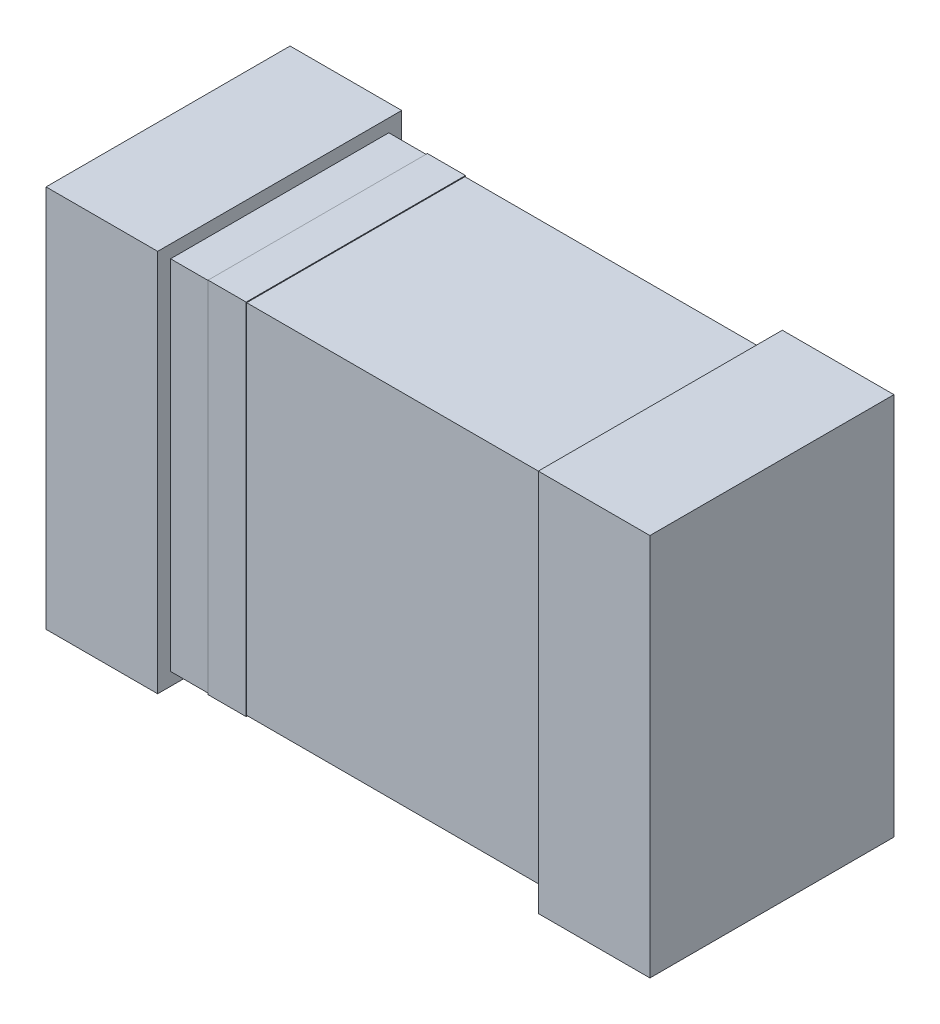
ISO-10303-21;
HEADER;
FILE_DESCRIPTION(('STEP AP214'),'2;1');
FILE_NAME('part.step','',(''),(''),'','','');
FILE_SCHEMA(('AUTOMOTIVE_DESIGN { 1 0 10303 214 1 1 1 1 }'));
ENDSEC;
DATA;
#1=APPLICATION_CONTEXT('core data for automotive mechanical design processes');
#2=APPLICATION_PROTOCOL_DEFINITION('international standard','automotive_design',2000,#1);
#3=PRODUCT_CONTEXT('',#1,'mechanical');
#4=PRODUCT('Part','Part','',(#3));
#5=PRODUCT_RELATED_PRODUCT_CATEGORY('part','',(#4));
#6=PRODUCT_DEFINITION_FORMATION('','',#4);
#7=PRODUCT_DEFINITION_CONTEXT('part definition',#1,'design');
#8=PRODUCT_DEFINITION('design','',#6,#7);
#9=PRODUCT_DEFINITION_SHAPE('','',#8);
#10=(LENGTH_UNIT() NAMED_UNIT(*) SI_UNIT(.MILLI.,.METRE.));
#11=(NAMED_UNIT(*) PLANE_ANGLE_UNIT() SI_UNIT($,.RADIAN.));
#12=(NAMED_UNIT(*) SI_UNIT($,.STERADIAN.) SOLID_ANGLE_UNIT());
#13=UNCERTAINTY_MEASURE_WITH_UNIT(LENGTH_MEASURE(1.E-05),#10,'distance_accuracy_value','');
#14=(GEOMETRIC_REPRESENTATION_CONTEXT(3) GLOBAL_UNCERTAINTY_ASSIGNED_CONTEXT((#13)) GLOBAL_UNIT_ASSIGNED_CONTEXT((#10,
#11,#12)) REPRESENTATION_CONTEXT('',''));
#15=CARTESIAN_POINT('',(0.,0.,0.));
#16=DIRECTION('',(0.,0.,1.));
#17=DIRECTION('',(1.,0.,0.));
#18=AXIS2_PLACEMENT_3D('',#15,#16,#17);
#19=CARTESIAN_POINT('',(0.624,-0.5859,0.0423));
#20=CARTESIAN_POINT('',(-0.624,-0.5859,0.0423));
#21=CARTESIAN_POINT('',(0.624,-0.5859,0.7578));
#22=CARTESIAN_POINT('',(-0.624,-0.5859,0.7578));
#23=B_SPLINE_SURFACE_WITH_KNOTS('',1,1,((#19,#20),(#21,#22)),.UNSPECIFIED.,.F.,.F.,.F.,(2,2),(2,
2),(0.,0.795),(-2.08,0.),.UNSPECIFIED.);
#24=DIRECTION('',(-1.,0.,0.));
#25=VECTOR('',#24,1.);
#26=CARTESIAN_POINT('',(0.624,-0.5859,0.0423));
#27=LINE('',#26,#25);
#28=CARTESIAN_POINT('',(0.624,-0.5859,0.0423));
#29=VERTEX_POINT('',#28);
#30=CARTESIAN_POINT('',(-0.624,-0.5859,0.0423));
#31=VERTEX_POINT('',#30);
#32=EDGE_CURVE('P0_E11',#29,#31,#27,.T.);
#33=DIRECTION('',(0.,0.,-1.));
#34=VECTOR('',#33,1.);
#35=CARTESIAN_POINT('',(0.624,-0.5859,0.7578));
#36=LINE('',#35,#34);
#37=CARTESIAN_POINT('',(0.624,-0.5859,0.7578));
#38=VERTEX_POINT('',#37);
#39=EDGE_CURVE('P0_E27',#38,#29,#36,.T.);
#40=DIRECTION('',(1.,0.,0.));
#41=VECTOR('',#40,1.);
#42=CARTESIAN_POINT('',(-0.624,-0.5859,0.7578));
#43=LINE('',#42,#41);
#44=CARTESIAN_POINT('',(-0.624,-0.5859,0.7578));
#45=VERTEX_POINT('',#44);
#46=EDGE_CURVE('P0_E98',#45,#38,#43,.T.);
#47=DIRECTION('',(0.,0.,1.));
#48=VECTOR('',#47,1.);
#49=CARTESIAN_POINT('',(-0.624,-0.5859,0.0423));
#50=LINE('',#49,#48);
#51=EDGE_CURVE('P0_E93',#31,#45,#50,.T.);
#52=ORIENTED_EDGE('',*,*,#32,.F.);
#53=ORIENTED_EDGE('',*,*,#39,.F.);
#54=ORIENTED_EDGE('',*,*,#46,.F.);
#55=ORIENTED_EDGE('',*,*,#51,.F.);
#56=EDGE_LOOP('',(#52,#53,#54,#55));
#57=FACE_BOUND('',#56,.T.);
#58=ADVANCED_FACE('P0_F17',(#57),#23,.T.);
#59=CARTESIAN_POINT('',(-0.624,-0.5859,0.0423));
#60=CARTESIAN_POINT('',(-0.624,0.5859,0.0423));
#61=CARTESIAN_POINT('',(-0.624,-0.5859,0.7578));
#62=CARTESIAN_POINT('',(-0.624,0.5859,0.7578));
#63=B_SPLINE_SURFACE_WITH_KNOTS('',1,1,((#59,#60),(#61,#62)),.UNSPECIFIED.,.F.,.F.,.F.,(2,2),(2,
2),(0.,0.795),(-1.302,0.),.UNSPECIFIED.);
#64=DIRECTION('',(0.,1.,0.));
#65=VECTOR('',#64,1.);
#66=CARTESIAN_POINT('',(-0.624,-0.5859,0.0423));
#67=LINE('',#66,#65);
#68=CARTESIAN_POINT('',(-0.624,0.5859,0.0423));
#69=VERTEX_POINT('',#68);
#70=EDGE_CURVE('P0_E75',#31,#69,#67,.T.);
#71=DIRECTION('',(0.,-1.,0.));
#72=VECTOR('',#71,1.);
#73=CARTESIAN_POINT('',(-0.624,0.5859,0.7578));
#74=LINE('',#73,#72);
#75=CARTESIAN_POINT('',(-0.624,0.5859,0.7578));
#76=VERTEX_POINT('',#75);
#77=EDGE_CURVE('P0_E78',#76,#45,#74,.T.);
#78=DIRECTION('',(0.,0.,-1.));
#79=VECTOR('',#78,1.);
#80=CARTESIAN_POINT('',(-0.624,0.5859,0.7578));
#81=LINE('',#80,#79);
#82=EDGE_CURVE('P0_E76',#76,#69,#81,.T.);
#83=ORIENTED_EDGE('',*,*,#70,.F.);
#84=ORIENTED_EDGE('',*,*,#51,.T.);
#85=ORIENTED_EDGE('',*,*,#77,.F.);
#86=ORIENTED_EDGE('',*,*,#82,.T.);
#87=EDGE_LOOP('',(#83,#84,#85,#86));
#88=FACE_BOUND('',#87,.T.);
#89=ADVANCED_FACE('P0_F110',(#88),#63,.T.);
#90=CARTESIAN_POINT('',(-0.624,0.5859,0.0423));
#91=CARTESIAN_POINT('',(0.624,0.5859,0.0423));
#92=CARTESIAN_POINT('',(-0.624,0.5859,0.7578));
#93=CARTESIAN_POINT('',(0.624,0.5859,0.7578));
#94=B_SPLINE_SURFACE_WITH_KNOTS('',1,1,((#90,#91),(#92,#93)),.UNSPECIFIED.,.F.,.F.,.F.,(2,2),(2,
2),(0.,0.795),(-2.08,0.),.UNSPECIFIED.);
#95=DIRECTION('',(1.,0.,0.));
#96=VECTOR('',#95,1.);
#97=CARTESIAN_POINT('',(-0.624,0.5859,0.0423));
#98=LINE('',#97,#96);
#99=CARTESIAN_POINT('',(0.624,0.5859,0.0423));
#100=VERTEX_POINT('',#99);
#101=EDGE_CURVE('P0_E61',#69,#100,#98,.T.);
#102=DIRECTION('',(-1.,0.,0.));
#103=VECTOR('',#102,1.);
#104=CARTESIAN_POINT('',(0.624,0.5859,0.7578));
#105=LINE('',#104,#103);
#106=CARTESIAN_POINT('',(0.624,0.5859,0.7578));
#107=VERTEX_POINT('',#106);
#108=EDGE_CURVE('P0_E64',#107,#76,#105,.T.);
#109=DIRECTION('',(0.,0.,-1.));
#110=VECTOR('',#109,1.);
#111=CARTESIAN_POINT('',(0.624,0.5859,0.7578));
#112=LINE('',#111,#110);
#113=EDGE_CURVE('P0_E56',#107,#100,#112,.T.);
#114=ORIENTED_EDGE('',*,*,#101,.F.);
#115=ORIENTED_EDGE('',*,*,#82,.F.);
#116=ORIENTED_EDGE('',*,*,#108,.F.);
#117=ORIENTED_EDGE('',*,*,#113,.T.);
#118=EDGE_LOOP('',(#114,#115,#116,#117));
#119=FACE_BOUND('',#118,.T.);
#120=ADVANCED_FACE('P0_F58',(#119),#94,.T.);
#121=CARTESIAN_POINT('',(0.624,0.5859,0.0423));
#122=CARTESIAN_POINT('',(0.624,-0.5859,0.0423));
#123=CARTESIAN_POINT('',(0.624,0.5859,0.7578));
#124=CARTESIAN_POINT('',(0.624,-0.5859,0.7578));
#125=B_SPLINE_SURFACE_WITH_KNOTS('',1,1,((#121,#122),(#123,#124)),.UNSPECIFIED.,.F.,.F.,.F.,(2,
2),(2,2),(0.,0.795),(-1.302,0.),.UNSPECIFIED.);
#126=DIRECTION('',(0.,-1.,0.));
#127=VECTOR('',#126,1.);
#128=CARTESIAN_POINT('',(0.624,0.5859,0.0423));
#129=LINE('',#128,#127);
#130=EDGE_CURVE('P0_E67',#100,#29,#129,.T.);
#131=DIRECTION('',(0.,1.,0.));
#132=VECTOR('',#131,1.);
#133=CARTESIAN_POINT('',(0.624,-0.5859,0.7578));
#134=LINE('',#133,#132);
#135=EDGE_CURVE('P0_E71',#38,#107,#134,.T.);
#136=ORIENTED_EDGE('',*,*,#130,.F.);
#137=ORIENTED_EDGE('',*,*,#113,.F.);
#138=ORIENTED_EDGE('',*,*,#135,.F.);
#139=ORIENTED_EDGE('',*,*,#39,.T.);
#140=EDGE_LOOP('',(#136,#137,#138,#139));
#141=FACE_BOUND('',#140,.T.);
#142=ADVANCED_FACE('P0_F69',(#141),#125,.T.);
#143=CARTESIAN_POINT('',(0.624,-0.5859,0.7578));
#144=CARTESIAN_POINT('',(-0.624,-0.5859,0.7578));
#145=CARTESIAN_POINT('',(0.624,0.5859,0.7578));
#146=CARTESIAN_POINT('',(-0.624,0.5859,0.7578));
#147=B_SPLINE_SURFACE_WITH_KNOTS('',1,1,((#143,#144),(#145,#146)),.UNSPECIFIED.,.F.,.F.,.F.,(2,
2),(2,2),(0.,1.302),(-2.08,0.),.UNSPECIFIED.);
#148=ORIENTED_EDGE('',*,*,#46,.T.);
#149=ORIENTED_EDGE('',*,*,#135,.T.);
#150=ORIENTED_EDGE('',*,*,#108,.T.);
#151=ORIENTED_EDGE('',*,*,#77,.T.);
#152=EDGE_LOOP('',(#148,#149,#150,#151));
#153=FACE_BOUND('',#152,.T.);
#154=ADVANCED_FACE('P0_F108',(#153),#147,.T.);
#155=CARTESIAN_POINT('',(-0.624,-0.5859,0.0423));
#156=CARTESIAN_POINT('',(0.624,-0.5859,0.0423));
#157=CARTESIAN_POINT('',(-0.624,0.5859,0.0423));
#158=CARTESIAN_POINT('',(0.624,0.5859,0.0423));
#159=B_SPLINE_SURFACE_WITH_KNOTS('',1,1,((#155,#156),(#157,#158)),.UNSPECIFIED.,.F.,.F.,.F.,(2,
2),(2,2),(-1.302,0.),(0.,2.08),.UNSPECIFIED.);
#160=ORIENTED_EDGE('',*,*,#101,.T.);
#161=ORIENTED_EDGE('',*,*,#130,.T.);
#162=ORIENTED_EDGE('',*,*,#32,.T.);
#163=ORIENTED_EDGE('',*,*,#70,.T.);
#164=EDGE_LOOP('',(#160,#161,#162,#163));
#165=FACE_BOUND('',#164,.T.);
#166=ADVANCED_FACE('P0_F73',(#165),#159,.T.);
#167=CLOSED_SHELL('',(#58,#89,#120,#142,#154,#166));
#168=MANIFOLD_SOLID_BREP('P0_B1',#167);
#169=CARTESIAN_POINT('',(0.99,-0.6282,0.));
#170=CARTESIAN_POINT('',(0.624,-0.6282,0.));
#171=CARTESIAN_POINT('',(0.99,-0.6282,0.8001));
#172=CARTESIAN_POINT('',(0.624,-0.6282,0.8001));
#173=B_SPLINE_SURFACE_WITH_KNOTS('',1,1,((#169,#170),(#171,#172)),.UNSPECIFIED.,.F.,.F.,.F.,(2,
2),(2,2),(0.,0.889),(-0.61,0.),.UNSPECIFIED.);
#174=DIRECTION('',(-1.,0.,0.));
#175=VECTOR('',#174,1.);
#176=CARTESIAN_POINT('',(0.99,-0.6282,0.));
#177=LINE('',#176,#175);
#178=CARTESIAN_POINT('',(0.99,-0.6282,0.));
#179=VERTEX_POINT('',#178);
#180=CARTESIAN_POINT('',(0.624,-0.6282,0.));
#181=VERTEX_POINT('',#180);
#182=EDGE_CURVE('P1_E11',#179,#181,#177,.T.);
#183=DIRECTION('',(0.,0.,-1.));
#184=VECTOR('',#183,1.);
#185=CARTESIAN_POINT('',(0.99,-0.6282,0.8001));
#186=LINE('',#185,#184);
#187=CARTESIAN_POINT('',(0.99,-0.6282,0.8001));
#188=VERTEX_POINT('',#187);
#189=EDGE_CURVE('P1_E27',#188,#179,#186,.T.);
#190=DIRECTION('',(1.,0.,0.));
#191=VECTOR('',#190,1.);
#192=CARTESIAN_POINT('',(0.624,-0.6282,0.8001));
#193=LINE('',#192,#191);
#194=CARTESIAN_POINT('',(0.624,-0.6282,0.8001));
#195=VERTEX_POINT('',#194);
#196=EDGE_CURVE('P1_E98',#195,#188,#193,.T.);
#197=DIRECTION('',(0.,0.,1.));
#198=VECTOR('',#197,1.);
#199=CARTESIAN_POINT('',(0.624,-0.6282,0.));
#200=LINE('',#199,#198);
#201=EDGE_CURVE('P1_E93',#181,#195,#200,.T.);
#202=ORIENTED_EDGE('',*,*,#182,.F.);
#203=ORIENTED_EDGE('',*,*,#189,.F.);
#204=ORIENTED_EDGE('',*,*,#196,.F.);
#205=ORIENTED_EDGE('',*,*,#201,.F.);
#206=EDGE_LOOP('',(#202,#203,#204,#205));
#207=FACE_BOUND('',#206,.T.);
#208=ADVANCED_FACE('P1_F17',(#207),#173,.T.);
#209=CARTESIAN_POINT('',(0.624,-0.6282,0.));
#210=CARTESIAN_POINT('',(0.624,0.6282,0.));
#211=CARTESIAN_POINT('',(0.624,-0.6282,0.8001));
#212=CARTESIAN_POINT('',(0.624,0.6282,0.8001));
#213=B_SPLINE_SURFACE_WITH_KNOTS('',1,1,((#209,#210),(#211,#212)),.UNSPECIFIED.,.F.,.F.,.F.,(2,
2),(2,2),(0.,0.889),(-1.396,0.),.UNSPECIFIED.);
#214=DIRECTION('',(0.,1.,0.));
#215=VECTOR('',#214,1.);
#216=CARTESIAN_POINT('',(0.624,-0.6282,0.));
#217=LINE('',#216,#215);
#218=CARTESIAN_POINT('',(0.624,0.6282,0.));
#219=VERTEX_POINT('',#218);
#220=EDGE_CURVE('P1_E75',#181,#219,#217,.T.);
#221=DIRECTION('',(0.,-1.,0.));
#222=VECTOR('',#221,1.);
#223=CARTESIAN_POINT('',(0.624,0.6282,0.8001));
#224=LINE('',#223,#222);
#225=CARTESIAN_POINT('',(0.624,0.6282,0.8001));
#226=VERTEX_POINT('',#225);
#227=EDGE_CURVE('P1_E78',#226,#195,#224,.T.);
#228=DIRECTION('',(0.,0.,-1.));
#229=VECTOR('',#228,1.);
#230=CARTESIAN_POINT('',(0.624,0.6282,0.8001));
#231=LINE('',#230,#229);
#232=EDGE_CURVE('P1_E76',#226,#219,#231,.T.);
#233=ORIENTED_EDGE('',*,*,#220,.F.);
#234=ORIENTED_EDGE('',*,*,#201,.T.);
#235=ORIENTED_EDGE('',*,*,#227,.F.);
#236=ORIENTED_EDGE('',*,*,#232,.T.);
#237=EDGE_LOOP('',(#233,#234,#235,#236));
#238=FACE_BOUND('',#237,.T.);
#239=ADVANCED_FACE('P1_F110',(#238),#213,.T.);
#240=CARTESIAN_POINT('',(0.624,0.6282,0.));
#241=CARTESIAN_POINT('',(0.99,0.6282,0.));
#242=CARTESIAN_POINT('',(0.624,0.6282,0.8001));
#243=CARTESIAN_POINT('',(0.99,0.6282,0.8001));
#244=B_SPLINE_SURFACE_WITH_KNOTS('',1,1,((#240,#241),(#242,#243)),.UNSPECIFIED.,.F.,.F.,.F.,(2,
2),(2,2),(0.,0.889),(-0.61,0.),.UNSPECIFIED.);
#245=DIRECTION('',(1.,0.,0.));
#246=VECTOR('',#245,1.);
#247=CARTESIAN_POINT('',(0.624,0.6282,0.));
#248=LINE('',#247,#246);
#249=CARTESIAN_POINT('',(0.99,0.6282,0.));
#250=VERTEX_POINT('',#249);
#251=EDGE_CURVE('P1_E61',#219,#250,#248,.T.);
#252=DIRECTION('',(-1.,0.,0.));
#253=VECTOR('',#252,1.);
#254=CARTESIAN_POINT('',(0.99,0.6282,0.8001));
#255=LINE('',#254,#253);
#256=CARTESIAN_POINT('',(0.99,0.6282,0.8001));
#257=VERTEX_POINT('',#256);
#258=EDGE_CURVE('P1_E64',#257,#226,#255,.T.);
#259=DIRECTION('',(0.,0.,-1.));
#260=VECTOR('',#259,1.);
#261=CARTESIAN_POINT('',(0.99,0.6282,0.8001));
#262=LINE('',#261,#260);
#263=EDGE_CURVE('P1_E56',#257,#250,#262,.T.);
#264=ORIENTED_EDGE('',*,*,#251,.F.);
#265=ORIENTED_EDGE('',*,*,#232,.F.);
#266=ORIENTED_EDGE('',*,*,#258,.F.);
#267=ORIENTED_EDGE('',*,*,#263,.T.);
#268=EDGE_LOOP('',(#264,#265,#266,#267));
#269=FACE_BOUND('',#268,.T.);
#270=ADVANCED_FACE('P1_F58',(#269),#244,.T.);
#271=CARTESIAN_POINT('',(0.99,0.6282,0.));
#272=CARTESIAN_POINT('',(0.99,-0.6282,0.));
#273=CARTESIAN_POINT('',(0.99,0.6282,0.8001));
#274=CARTESIAN_POINT('',(0.99,-0.6282,0.8001));
#275=B_SPLINE_SURFACE_WITH_KNOTS('',1,1,((#271,#272),(#273,#274)),.UNSPECIFIED.,.F.,.F.,.F.,(2,
2),(2,2),(0.,0.889),(-1.396,0.),.UNSPECIFIED.);
#276=DIRECTION('',(0.,-1.,0.));
#277=VECTOR('',#276,1.);
#278=CARTESIAN_POINT('',(0.99,0.6282,0.));
#279=LINE('',#278,#277);
#280=EDGE_CURVE('P1_E67',#250,#179,#279,.T.);
#281=DIRECTION('',(0.,1.,0.));
#282=VECTOR('',#281,1.);
#283=CARTESIAN_POINT('',(0.99,-0.6282,0.8001));
#284=LINE('',#283,#282);
#285=EDGE_CURVE('P1_E71',#188,#257,#284,.T.);
#286=ORIENTED_EDGE('',*,*,#280,.F.);
#287=ORIENTED_EDGE('',*,*,#263,.F.);
#288=ORIENTED_EDGE('',*,*,#285,.F.);
#289=ORIENTED_EDGE('',*,*,#189,.T.);
#290=EDGE_LOOP('',(#286,#287,#288,#289));
#291=FACE_BOUND('',#290,.T.);
#292=ADVANCED_FACE('P1_F69',(#291),#275,.T.);
#293=CARTESIAN_POINT('',(0.99,-0.6282,0.8001));
#294=CARTESIAN_POINT('',(0.624,-0.6282,0.8001));
#295=CARTESIAN_POINT('',(0.99,0.6282,0.8001));
#296=CARTESIAN_POINT('',(0.624,0.6282,0.8001));
#297=B_SPLINE_SURFACE_WITH_KNOTS('',1,1,((#293,#294),(#295,#296)),.UNSPECIFIED.,.F.,.F.,.F.,(2,
2),(2,2),(0.,1.396),(-0.61,0.),.UNSPECIFIED.);
#298=ORIENTED_EDGE('',*,*,#196,.T.);
#299=ORIENTED_EDGE('',*,*,#285,.T.);
#300=ORIENTED_EDGE('',*,*,#258,.T.);
#301=ORIENTED_EDGE('',*,*,#227,.T.);
#302=EDGE_LOOP('',(#298,#299,#300,#301));
#303=FACE_BOUND('',#302,.T.);
#304=ADVANCED_FACE('P1_F108',(#303),#297,.T.);
#305=CARTESIAN_POINT('',(0.624,-0.6282,0.));
#306=CARTESIAN_POINT('',(0.99,-0.6282,0.));
#307=CARTESIAN_POINT('',(0.624,0.6282,0.));
#308=CARTESIAN_POINT('',(0.99,0.6282,0.));
#309=B_SPLINE_SURFACE_WITH_KNOTS('',1,1,((#305,#306),(#307,#308)),.UNSPECIFIED.,.F.,.F.,.F.,(2,
2),(2,2),(-1.396,0.),(0.,0.61),.UNSPECIFIED.);
#310=ORIENTED_EDGE('',*,*,#251,.T.);
#311=ORIENTED_EDGE('',*,*,#280,.T.);
#312=ORIENTED_EDGE('',*,*,#182,.T.);
#313=ORIENTED_EDGE('',*,*,#220,.T.);
#314=EDGE_LOOP('',(#310,#311,#312,#313));
#315=FACE_BOUND('',#314,.T.);
#316=ADVANCED_FACE('P1_F73',(#315),#309,.T.);
#317=CLOSED_SHELL('',(#208,#239,#270,#292,#304,#316));
#318=MANIFOLD_SOLID_BREP('P1_B1',#317);
#319=CARTESIAN_POINT('',(-0.624,-0.6282,0.));
#320=CARTESIAN_POINT('',(-0.99,-0.6282,0.));
#321=CARTESIAN_POINT('',(-0.624,-0.6282,0.8001));
#322=CARTESIAN_POINT('',(-0.99,-0.6282,0.8001));
#323=B_SPLINE_SURFACE_WITH_KNOTS('',1,1,((#319,#320),(#321,#322)),.UNSPECIFIED.,.F.,.F.,.F.,(2,
2),(2,2),(0.,0.889),(-0.61,0.),.UNSPECIFIED.);
#324=DIRECTION('',(-1.,0.,0.));
#325=VECTOR('',#324,1.);
#326=CARTESIAN_POINT('',(-0.624,-0.6282,0.));
#327=LINE('',#326,#325);
#328=CARTESIAN_POINT('',(-0.624,-0.6282,0.));
#329=VERTEX_POINT('',#328);
#330=CARTESIAN_POINT('',(-0.99,-0.6282,0.));
#331=VERTEX_POINT('',#330);
#332=EDGE_CURVE('P2_E11',#329,#331,#327,.T.);
#333=DIRECTION('',(0.,0.,-1.));
#334=VECTOR('',#333,1.);
#335=CARTESIAN_POINT('',(-0.624,-0.6282,0.8001));
#336=LINE('',#335,#334);
#337=CARTESIAN_POINT('',(-0.624,-0.6282,0.8001));
#338=VERTEX_POINT('',#337);
#339=EDGE_CURVE('P2_E27',#338,#329,#336,.T.);
#340=DIRECTION('',(1.,0.,0.));
#341=VECTOR('',#340,1.);
#342=CARTESIAN_POINT('',(-0.99,-0.6282,0.8001));
#343=LINE('',#342,#341);
#344=CARTESIAN_POINT('',(-0.99,-0.6282,0.8001));
#345=VERTEX_POINT('',#344);
#346=EDGE_CURVE('P2_E98',#345,#338,#343,.T.);
#347=DIRECTION('',(0.,0.,1.));
#348=VECTOR('',#347,1.);
#349=CARTESIAN_POINT('',(-0.99,-0.6282,0.));
#350=LINE('',#349,#348);
#351=EDGE_CURVE('P2_E93',#331,#345,#350,.T.);
#352=ORIENTED_EDGE('',*,*,#332,.F.);
#353=ORIENTED_EDGE('',*,*,#339,.F.);
#354=ORIENTED_EDGE('',*,*,#346,.F.);
#355=ORIENTED_EDGE('',*,*,#351,.F.);
#356=EDGE_LOOP('',(#352,#353,#354,#355));
#357=FACE_BOUND('',#356,.T.);
#358=ADVANCED_FACE('P2_F17',(#357),#323,.T.);
#359=CARTESIAN_POINT('',(-0.99,-0.6282,0.));
#360=CARTESIAN_POINT('',(-0.99,0.6282,0.));
#361=CARTESIAN_POINT('',(-0.99,-0.6282,0.8001));
#362=CARTESIAN_POINT('',(-0.99,0.6282,0.8001));
#363=B_SPLINE_SURFACE_WITH_KNOTS('',1,1,((#359,#360),(#361,#362)),.UNSPECIFIED.,.F.,.F.,.F.,(2,
2),(2,2),(0.,0.889),(-1.396,0.),.UNSPECIFIED.);
#364=DIRECTION('',(0.,1.,0.));
#365=VECTOR('',#364,1.);
#366=CARTESIAN_POINT('',(-0.99,-0.6282,0.));
#367=LINE('',#366,#365);
#368=CARTESIAN_POINT('',(-0.99,0.6282,0.));
#369=VERTEX_POINT('',#368);
#370=EDGE_CURVE('P2_E75',#331,#369,#367,.T.);
#371=DIRECTION('',(0.,-1.,0.));
#372=VECTOR('',#371,1.);
#373=CARTESIAN_POINT('',(-0.99,0.6282,0.8001));
#374=LINE('',#373,#372);
#375=CARTESIAN_POINT('',(-0.99,0.6282,0.8001));
#376=VERTEX_POINT('',#375);
#377=EDGE_CURVE('P2_E78',#376,#345,#374,.T.);
#378=DIRECTION('',(0.,0.,-1.));
#379=VECTOR('',#378,1.);
#380=CARTESIAN_POINT('',(-0.99,0.6282,0.8001));
#381=LINE('',#380,#379);
#382=EDGE_CURVE('P2_E76',#376,#369,#381,.T.);
#383=ORIENTED_EDGE('',*,*,#370,.F.);
#384=ORIENTED_EDGE('',*,*,#351,.T.);
#385=ORIENTED_EDGE('',*,*,#377,.F.);
#386=ORIENTED_EDGE('',*,*,#382,.T.);
#387=EDGE_LOOP('',(#383,#384,#385,#386));
#388=FACE_BOUND('',#387,.T.);
#389=ADVANCED_FACE('P2_F110',(#388),#363,.T.);
#390=CARTESIAN_POINT('',(-0.99,0.6282,0.));
#391=CARTESIAN_POINT('',(-0.624,0.6282,0.));
#392=CARTESIAN_POINT('',(-0.99,0.6282,0.8001));
#393=CARTESIAN_POINT('',(-0.624,0.6282,0.8001));
#394=B_SPLINE_SURFACE_WITH_KNOTS('',1,1,((#390,#391),(#392,#393)),.UNSPECIFIED.,.F.,.F.,.F.,(2,
2),(2,2),(0.,0.889),(-0.61,0.),.UNSPECIFIED.);
#395=DIRECTION('',(1.,0.,0.));
#396=VECTOR('',#395,1.);
#397=CARTESIAN_POINT('',(-0.99,0.6282,0.));
#398=LINE('',#397,#396);
#399=CARTESIAN_POINT('',(-0.624,0.6282,0.));
#400=VERTEX_POINT('',#399);
#401=EDGE_CURVE('P2_E61',#369,#400,#398,.T.);
#402=DIRECTION('',(-1.,0.,0.));
#403=VECTOR('',#402,1.);
#404=CARTESIAN_POINT('',(-0.624,0.6282,0.8001));
#405=LINE('',#404,#403);
#406=CARTESIAN_POINT('',(-0.624,0.6282,0.8001));
#407=VERTEX_POINT('',#406);
#408=EDGE_CURVE('P2_E64',#407,#376,#405,.T.);
#409=DIRECTION('',(0.,0.,-1.));
#410=VECTOR('',#409,1.);
#411=CARTESIAN_POINT('',(-0.624,0.6282,0.8001));
#412=LINE('',#411,#410);
#413=EDGE_CURVE('P2_E56',#407,#400,#412,.T.);
#414=ORIENTED_EDGE('',*,*,#401,.F.);
#415=ORIENTED_EDGE('',*,*,#382,.F.);
#416=ORIENTED_EDGE('',*,*,#408,.F.);
#417=ORIENTED_EDGE('',*,*,#413,.T.);
#418=EDGE_LOOP('',(#414,#415,#416,#417));
#419=FACE_BOUND('',#418,.T.);
#420=ADVANCED_FACE('P2_F58',(#419),#394,.T.);
#421=CARTESIAN_POINT('',(-0.624,0.6282,0.));
#422=CARTESIAN_POINT('',(-0.624,-0.6282,0.));
#423=CARTESIAN_POINT('',(-0.624,0.6282,0.8001));
#424=CARTESIAN_POINT('',(-0.624,-0.6282,0.8001));
#425=B_SPLINE_SURFACE_WITH_KNOTS('',1,1,((#421,#422),(#423,#424)),.UNSPECIFIED.,.F.,.F.,.F.,(2,
2),(2,2),(0.,0.889),(-1.396,0.),.UNSPECIFIED.);
#426=DIRECTION('',(0.,-1.,0.));
#427=VECTOR('',#426,1.);
#428=CARTESIAN_POINT('',(-0.624,0.6282,0.));
#429=LINE('',#428,#427);
#430=EDGE_CURVE('P2_E67',#400,#329,#429,.T.);
#431=DIRECTION('',(0.,1.,0.));
#432=VECTOR('',#431,1.);
#433=CARTESIAN_POINT('',(-0.624,-0.6282,0.8001));
#434=LINE('',#433,#432);
#435=EDGE_CURVE('P2_E71',#338,#407,#434,.T.);
#436=ORIENTED_EDGE('',*,*,#430,.F.);
#437=ORIENTED_EDGE('',*,*,#413,.F.);
#438=ORIENTED_EDGE('',*,*,#435,.F.);
#439=ORIENTED_EDGE('',*,*,#339,.T.);
#440=EDGE_LOOP('',(#436,#437,#438,#439));
#441=FACE_BOUND('',#440,.T.);
#442=ADVANCED_FACE('P2_F69',(#441),#425,.T.);
#443=CARTESIAN_POINT('',(-0.624,-0.6282,0.8001));
#444=CARTESIAN_POINT('',(-0.99,-0.6282,0.8001));
#445=CARTESIAN_POINT('',(-0.624,0.6282,0.8001));
#446=CARTESIAN_POINT('',(-0.99,0.6282,0.8001));
#447=B_SPLINE_SURFACE_WITH_KNOTS('',1,1,((#443,#444),(#445,#446)),.UNSPECIFIED.,.F.,.F.,.F.,(2,
2),(2,2),(0.,1.396),(-0.61,0.),.UNSPECIFIED.);
#448=ORIENTED_EDGE('',*,*,#346,.T.);
#449=ORIENTED_EDGE('',*,*,#435,.T.);
#450=ORIENTED_EDGE('',*,*,#408,.T.);
#451=ORIENTED_EDGE('',*,*,#377,.T.);
#452=EDGE_LOOP('',(#448,#449,#450,#451));
#453=FACE_BOUND('',#452,.T.);
#454=ADVANCED_FACE('P2_F108',(#453),#447,.T.);
#455=CARTESIAN_POINT('',(-0.99,-0.6282,0.));
#456=CARTESIAN_POINT('',(-0.624,-0.6282,0.));
#457=CARTESIAN_POINT('',(-0.99,0.6282,0.));
#458=CARTESIAN_POINT('',(-0.624,0.6282,0.));
#459=B_SPLINE_SURFACE_WITH_KNOTS('',1,1,((#455,#456),(#457,#458)),.UNSPECIFIED.,.F.,.F.,.F.,(2,
2),(2,2),(-1.396,0.),(0.,0.61),.UNSPECIFIED.);
#460=ORIENTED_EDGE('',*,*,#401,.T.);
#461=ORIENTED_EDGE('',*,*,#430,.T.);
#462=ORIENTED_EDGE('',*,*,#332,.T.);
#463=ORIENTED_EDGE('',*,*,#370,.T.);
#464=EDGE_LOOP('',(#460,#461,#462,#463));
#465=FACE_BOUND('',#464,.T.);
#466=ADVANCED_FACE('P2_F73',(#465),#459,.T.);
#467=CLOSED_SHELL('',(#358,#389,#420,#442,#454,#466));
#468=MANIFOLD_SOLID_BREP('P2_B1',#467);
#469=CARTESIAN_POINT('',(-0.4992,-0.5886,0.0405));
#470=CARTESIAN_POINT('',(-0.3744,-0.5886,0.0405));
#471=CARTESIAN_POINT('',(-0.4992,0.5886,0.0405));
#472=CARTESIAN_POINT('',(-0.3744,0.5886,0.0405));
#473=B_SPLINE_SURFACE_WITH_KNOTS('',1,1,((#469,#470),(#471,#472)),.UNSPECIFIED.,.F.,.F.,.F.,(2,
2),(2,2),(0.,1.308),(0.,1.),.UNSPECIFIED.);
#474=DIRECTION('',(-1.,0.,0.));
#475=VECTOR('',#474,1.);
#476=CARTESIAN_POINT('',(-0.3744,0.5886,0.0405));
#477=LINE('',#476,#475);
#478=CARTESIAN_POINT('',(-0.3744,0.5886,0.0405));
#479=VERTEX_POINT('',#478);
#480=CARTESIAN_POINT('',(-0.4992,0.5886,0.0405));
#481=VERTEX_POINT('',#480);
#482=EDGE_CURVE('P3_E11',#479,#481,#477,.T.);
#483=DIRECTION('',(0.,1.,0.));
#484=VECTOR('',#483,1.);
#485=CARTESIAN_POINT('',(-0.3744,-0.5886,0.0405));
#486=LINE('',#485,#484);
#487=CARTESIAN_POINT('',(-0.3744,-0.5886,0.0405));
#488=VERTEX_POINT('',#487);
#489=EDGE_CURVE('P3_E27',#488,#479,#486,.T.);
#490=DIRECTION('',(1.,0.,0.));
#491=VECTOR('',#490,1.);
#492=CARTESIAN_POINT('',(-0.4992,-0.5886,0.0405));
#493=LINE('',#492,#491);
#494=CARTESIAN_POINT('',(-0.4992,-0.5886,0.0405));
#495=VERTEX_POINT('',#494);
#496=EDGE_CURVE('P3_E313',#495,#488,#493,.T.);
#497=DIRECTION('',(0.,-1.,0.));
#498=VECTOR('',#497,1.);
#499=CARTESIAN_POINT('',(-0.4992,0.5886,0.0405));
#500=LINE('',#499,#498);
#501=EDGE_CURVE('P3_E311',#481,#495,#500,.T.);
#502=ORIENTED_EDGE('',*,*,#482,.F.);
#503=ORIENTED_EDGE('',*,*,#489,.F.);
#504=ORIENTED_EDGE('',*,*,#496,.F.);
#505=ORIENTED_EDGE('',*,*,#501,.F.);
#506=EDGE_LOOP('',(#502,#503,#504,#505));
#507=FACE_BOUND('',#506,.T.);
#508=ADVANCED_FACE('P3_F17',(#507),#473,.T.);
#509=CARTESIAN_POINT('',(-0.4992,-0.5886,0.04005));
#510=CARTESIAN_POINT('',(-0.4992,0.5886,0.04005));
#511=CARTESIAN_POINT('',(-0.4992,-0.5886,0.7596));
#512=CARTESIAN_POINT('',(-0.4992,0.5886,0.7596));
#513=B_SPLINE_SURFACE_WITH_KNOTS('',1,1,((#509,#510),(#511,#512)),.UNSPECIFIED.,.F.,.F.,.F.,(2,
2),(2,2),(-0.0005,0.799),(-1.308,0.),.UNSPECIFIED.);
#514=CARTESIAN_POINT('',(-0.4992,-0.5859,0.0423));
#515=CARTESIAN_POINT('',(-0.4992,-0.585993735142403,0.0422062639200135));
#516=CARTESIAN_POINT('',(-0.4992,-0.58608749826612,0.0421125016768239));
#517=CARTESIAN_POINT('',(-0.4992,-0.586276781722621,0.0419267343713832));
#518=CARTESIAN_POINT('',(-0.4992,-0.58637230246205,0.0418347297260684));
#519=CARTESIAN_POINT('',(-0.4992,-0.586566907976538,0.0416541955323229));
#520=CARTESIAN_POINT('',(-0.4992,-0.586665997953318,0.0415656714844321));
#521=CARTESIAN_POINT('',(-0.4992,-0.586818381228817,0.0414370002784137));
#522=CARTESIAN_POINT('',(-0.4992,-0.586869883889863,0.0413947328058684));
#523=CARTESIAN_POINT('',(-0.4992,-0.586974427970702,0.0413117280653649));
#524=CARTESIAN_POINT('',(-0.4992,-0.587027474436501,0.04127099712993));
#525=CARTESIAN_POINT('',(-0.4992,-0.58713532359097,0.0411912825890379));
#526=CARTESIAN_POINT('',(-0.4992,-0.587190134383442,0.0411523099184189));
#527=CARTESIAN_POINT('',(-0.4992,-0.587301729089315,0.0410763260499531));
#528=CARTESIAN_POINT('',(-0.4992,-0.587358525043825,0.041039332489288));
#529=CARTESIAN_POINT('',(-0.4992,-0.587474305905673,0.0409675192010876));
#530=CARTESIAN_POINT('',(-0.4992,-0.587533307530253,0.0409327263625079));
#531=CARTESIAN_POINT('',(-0.4992,-0.587653714783258,0.0408655241180873));
#532=CARTESIAN_POINT('',(-0.4992,-0.587715142233673,0.0408331537315954));
#533=CARTESIAN_POINT('',(-0.4992,-0.587840615778612,0.0407710035166399));
#534=CARTESIAN_POINT('',(-0.4992,-0.587904688746364,0.0407412778607145));
#535=CARTESIAN_POINT('',(-0.4992,-0.588035667878086,0.0406846199121212));
#536=CARTESIAN_POINT('',(-0.4992,-0.588102605296496,0.0406577597912359));
#537=CARTESIAN_POINT('',(-0.4992,-0.588239529275563,0.0406070383472301));
#538=CARTESIAN_POINT('',(-0.4992,-0.588309550161255,0.0405832697234303));
#539=CARTESIAN_POINT('',(-0.4992,-0.588452855882658,0.0405389139686466));
#540=CARTESIAN_POINT('',(-0.4992,-0.58852617612056,0.0405184411037751));
#541=CARTESIAN_POINT('',(-0.4992,-0.5886,0.0405));
#542=B_SPLINE_CURVE_WITH_KNOTS('',3,(#514,#515,#516,#517,#518,#519,#520,#521,#522,#523,#524,
#525,#526,#527,#528,#529,#530,#531,#532,#533,#534,#535,#536,#537,#538,#539,#540,#541),
.UNSPECIFIED.,.F.,.F.,(4,2,2,2,2,2,2,2,2,2,2,2,2,4),(0.,0.000397749506539428,
0.000795592223787354,0.00119404027913931,0.00139389055657924,0.001594490258461,
0.001796201696195,0.00199948386034232,0.00220489946531643,0.00241311916605503,
0.00262492240881615,0.00284119457749307,0.00306292040021625,0.0032911739460783),.UNSPECIFIED.);
#543=CARTESIAN_POINT('',(-0.4992,-0.5859,0.0423));
#544=VERTEX_POINT('',#543);
#545=EDGE_CURVE('P3_E166',#544,#495,#542,.T.);
#546=DIRECTION('',(0.,-1.,0.));
#547=VECTOR('',#546,1.);
#548=CARTESIAN_POINT('',(-0.4992,0.5859,0.0423));
#549=LINE('',#548,#547);
#550=CARTESIAN_POINT('',(-0.4992,0.5859,0.0423));
#551=VERTEX_POINT('',#550);
#552=EDGE_CURVE('P3_E333',#551,#544,#549,.T.);
#553=DIRECTION('',(0.,0.,-1.));
#554=VECTOR('',#553,1.);
#555=CARTESIAN_POINT('',(-0.4992,0.5859,0.7578));
#556=LINE('',#555,#554);
#557=CARTESIAN_POINT('',(-0.4992,0.5859,0.7578));
#558=VERTEX_POINT('',#557);
#559=EDGE_CURVE('P3_E332',#558,#551,#556,.T.);
#560=CARTESIAN_POINT('',(-0.4992,0.5886,0.7596));
#561=CARTESIAN_POINT('',(-0.4992,0.588506264857597,0.759506263920014));
#562=CARTESIAN_POINT('',(-0.4992,0.58841250173388,0.759412501676824));
#563=CARTESIAN_POINT('',(-0.4992,0.588223218277379,0.759226734371383));
#564=CARTESIAN_POINT('',(-0.4992,0.588127697537949,0.759134729726069));
#565=CARTESIAN_POINT('',(-0.4992,0.587933092023462,0.758954195532323));
#566=CARTESIAN_POINT('',(-0.4992,0.587834002046682,0.758865671484432));
#567=CARTESIAN_POINT('',(-0.4992,0.587681618771183,0.758737000278414));
#568=CARTESIAN_POINT('',(-0.4992,0.587630116110136,0.758694732805868));
#569=CARTESIAN_POINT('',(-0.4992,0.587525572029298,0.758611728065365));
#570=CARTESIAN_POINT('',(-0.4992,0.587472525563499,0.75857099712993));
#571=CARTESIAN_POINT('',(-0.4992,0.58736467640903,0.758491282589038));
#572=CARTESIAN_POINT('',(-0.4992,0.587309865616558,0.758452309918419));
#573=CARTESIAN_POINT('',(-0.4992,0.587198270910685,0.758376326049953));
#574=CARTESIAN_POINT('',(-0.4992,0.587141474956175,0.758339332489288));
#575=CARTESIAN_POINT('',(-0.4992,0.587025694094327,0.758267519201087));
#576=CARTESIAN_POINT('',(-0.4992,0.586966692469747,0.758232726362508));
#577=CARTESIAN_POINT('',(-0.4992,0.586846285216742,0.758165524118087));
#578=CARTESIAN_POINT('',(-0.4992,0.586784857766327,0.758133153731595));
#579=CARTESIAN_POINT('',(-0.4992,0.586659384221388,0.75807100351664));
#580=CARTESIAN_POINT('',(-0.4992,0.586595311253636,0.758041277860715));
#581=CARTESIAN_POINT('',(-0.4992,0.586464332121913,0.757984619912121));
#582=CARTESIAN_POINT('',(-0.4992,0.586397394703504,0.757957759791236));
#583=CARTESIAN_POINT('',(-0.4992,0.586260470724436,0.75790703834723));
#584=CARTESIAN_POINT('',(-0.4992,0.586190449838745,0.75788326972343));
#585=CARTESIAN_POINT('',(-0.4992,0.586047144117341,0.757838913968646));
#586=CARTESIAN_POINT('',(-0.4992,0.58597382387944,0.757818441103775));
#587=CARTESIAN_POINT('',(-0.4992,0.5859,0.7578));
#588=B_SPLINE_CURVE_WITH_KNOTS('',3,(#560,#561,#562,#563,#564,#565,#566,#567,#568,#569,#570,
#571,#572,#573,#574,#575,#576,#577,#578,#579,#580,#581,#582,#583,#584,#585,#586,#587),
.UNSPECIFIED.,.F.,.F.,(4,2,2,2,2,2,2,2,2,2,2,2,2,4),(0.,0.000397749506539332,
0.000795592223787457,0.0011940402791393,0.00139389055657941,0.00159449025846113,
0.00179620169619526,0.00199948386034232,0.00220489946531661,0.00241311916605521,
0.00262492240881641,0.00284119457749343,0.00306292040021644,0.00329117394607862),.UNSPECIFIED.);
#589=CARTESIAN_POINT('',(-0.4992,0.5886,0.7596));
#590=VERTEX_POINT('',#589);
#591=EDGE_CURVE('P3_E88',#590,#558,#588,.T.);
#592=DIRECTION('',(0.,0.,-1.));
#593=VECTOR('',#592,1.);
#594=CARTESIAN_POINT('',(-0.4992,0.5886,0.7596));
#595=LINE('',#594,#593);
#596=EDGE_CURVE('P3_E267',#590,#481,#595,.T.);
#597=ORIENTED_EDGE('',*,*,#501,.T.);
#598=ORIENTED_EDGE('',*,*,#545,.F.);
#599=ORIENTED_EDGE('',*,*,#552,.F.);
#600=ORIENTED_EDGE('',*,*,#559,.F.);
#601=ORIENTED_EDGE('',*,*,#591,.F.);
#602=ORIENTED_EDGE('',*,*,#596,.T.);
#603=EDGE_LOOP('',(#597,#598,#599,#600,#601,#602));
#604=FACE_BOUND('',#603,.T.);
#605=ADVANCED_FACE('P3_F278',(#604),#513,.T.);
#606=CARTESIAN_POINT('',(-0.4992,0.5886,0.0405));
#607=CARTESIAN_POINT('',(-0.3744,0.5886,0.0405));
#608=CARTESIAN_POINT('',(-0.4992,0.5886,0.7596));
#609=CARTESIAN_POINT('',(-0.3744,0.5886,0.7596));
#610=B_SPLINE_SURFACE_WITH_KNOTS('',1,1,((#606,#607),(#608,#609)),.UNSPECIFIED.,.F.,.F.,.F.,(2,
2),(2,2),(0.,0.799),(0.,1.),.UNSPECIFIED.);
#611=DIRECTION('',(-1.,0.,0.));
#612=VECTOR('',#611,1.);
#613=CARTESIAN_POINT('',(-0.3744,0.5886,0.7596));
#614=LINE('',#613,#612);
#615=CARTESIAN_POINT('',(-0.3744,0.5886,0.7596));
#616=VERTEX_POINT('',#615);
#617=EDGE_CURVE('P3_E262',#616,#590,#614,.T.);
#618=DIRECTION('',(0.,0.,1.));
#619=VECTOR('',#618,1.);
#620=CARTESIAN_POINT('',(-0.3744,0.5886,0.0405));
#621=LINE('',#620,#619);
#622=EDGE_CURVE('P3_E260',#479,#616,#621,.T.);
#623=ORIENTED_EDGE('',*,*,#482,.T.);
#624=ORIENTED_EDGE('',*,*,#596,.F.);
#625=ORIENTED_EDGE('',*,*,#617,.F.);
#626=ORIENTED_EDGE('',*,*,#622,.F.);
#627=EDGE_LOOP('',(#623,#624,#625,#626));
#628=FACE_BOUND('',#627,.T.);
#629=ADVANCED_FACE('P3_F288',(#628),#610,.T.);
#630=CARTESIAN_POINT('',(-0.3744,0.5886,0.0405));
#631=CARTESIAN_POINT('',(-0.3744,-0.5886,0.0405));
#632=CARTESIAN_POINT('',(-0.3744,0.5886,0.76005));
#633=CARTESIAN_POINT('',(-0.3744,-0.5886,0.76005));
#634=B_SPLINE_SURFACE_WITH_KNOTS('',1,1,((#630,#631),(#632,#633)),.UNSPECIFIED.,.F.,.F.,.F.,(2,
2),(2,2),(0.,0.7995),(-1.308,0.),.UNSPECIFIED.);
#635=CARTESIAN_POINT('',(-0.3744,0.5859,0.7578));
#636=CARTESIAN_POINT('',(-0.3744,0.585975,0.757875));
#637=CARTESIAN_POINT('',(-0.3744,0.58605,0.75795));
#638=CARTESIAN_POINT('',(-0.3744,0.5862,0.7581));
#639=CARTESIAN_POINT('',(-0.3744,0.586275,0.758175));
#640=CARTESIAN_POINT('',(-0.3744,0.586425,0.758325));
#641=CARTESIAN_POINT('',(-0.3744,0.5865,0.7584));
#642=CARTESIAN_POINT('',(-0.3744,0.58665,0.75855));
#643=CARTESIAN_POINT('',(-0.3744,0.586725,0.758625));
#644=CARTESIAN_POINT('',(-0.3744,0.586875,0.758775));
#645=CARTESIAN_POINT('',(-0.3744,0.58695,0.75885));
#646=CARTESIAN_POINT('',(-0.3744,0.5871,0.759));
#647=CARTESIAN_POINT('',(-0.3744,0.587175,0.759075));
#648=CARTESIAN_POINT('',(-0.3744,0.587325,0.759225));
#649=CARTESIAN_POINT('',(-0.3744,0.5874,0.7593));
#650=CARTESIAN_POINT('',(-0.3744,0.58755,0.75945));
#651=CARTESIAN_POINT('',(-0.3744,0.587625,0.759525));
#652=CARTESIAN_POINT('',(-0.3744,0.5877,0.7596));
#653=B_SPLINE_CURVE_WITH_KNOTS('',3,(#635,#636,#637,#638,#639,#640,#641,#642,#643,#644,#645,
#646,#647,#648,#649,#650,#651,#652),.UNSPECIFIED.,.F.,.F.,(4,2,2,2,2,2,2,2,4),(0.,
0.00031819805153382,0.000636396103067717,0.00095459415460169,0.00127279220613582,
0.00159099025766956,0.00190918830920376,0.00222738636073781,0.00254558441227179),.UNSPECIFIED.);
#654=CARTESIAN_POINT('',(-0.3744,0.5859,0.7578));
#655=VERTEX_POINT('',#654);
#656=EDGE_CURVE('P3_E247',#655,#616,#653,.T.);
#657=DIRECTION('',(0.,0.,1.));
#658=VECTOR('',#657,1.);
#659=CARTESIAN_POINT('',(-0.3744,0.5859,0.0423));
#660=LINE('',#659,#658);
#661=CARTESIAN_POINT('',(-0.3744,0.5859,0.0423));
#662=VERTEX_POINT('',#661);
#663=EDGE_CURVE('P3_E242',#662,#655,#660,.T.);
#664=DIRECTION('',(0.,1.,0.));
#665=VECTOR('',#664,1.);
#666=CARTESIAN_POINT('',(-0.3744,-0.5859,0.0423));
#667=LINE('',#666,#665);
#668=CARTESIAN_POINT('',(-0.3744,-0.5859,0.0423));
#669=VERTEX_POINT('',#668);
#670=EDGE_CURVE('P3_E239',#669,#662,#667,.T.);
#671=CARTESIAN_POINT('',(-0.3744,-0.5886,0.0405));
#672=CARTESIAN_POINT('',(-0.3744,-0.588506264857597,0.0405937360799865));
#673=CARTESIAN_POINT('',(-0.3744,-0.58841250173388,0.0406874983231761));
#674=CARTESIAN_POINT('',(-0.3744,-0.588223218277379,0.0408732656286167));
#675=CARTESIAN_POINT('',(-0.3744,-0.588127697537949,0.0409652702739315));
#676=CARTESIAN_POINT('',(-0.3744,-0.587933092023462,0.0411458044676771));
#677=CARTESIAN_POINT('',(-0.3744,-0.587834002046682,0.041234328515568));
#678=CARTESIAN_POINT('',(-0.3744,-0.587681618771183,0.0413629997215864));
#679=CARTESIAN_POINT('',(-0.3744,-0.587630116110136,0.0414052671941316));
#680=CARTESIAN_POINT('',(-0.3744,-0.587525572029298,0.0414882719346351));
#681=CARTESIAN_POINT('',(-0.3744,-0.587472525563499,0.04152900287007));
#682=CARTESIAN_POINT('',(-0.3744,-0.58736467640903,0.0416087174109621));
#683=CARTESIAN_POINT('',(-0.3744,-0.587309865616558,0.0416476900815812));
#684=CARTESIAN_POINT('',(-0.3744,-0.587198270910685,0.041723673950047));
#685=CARTESIAN_POINT('',(-0.3744,-0.587141474956175,0.0417606675107121));
#686=CARTESIAN_POINT('',(-0.3744,-0.587025694094327,0.0418324807989125));
#687=CARTESIAN_POINT('',(-0.3744,-0.586966692469747,0.0418672736374922));
#688=CARTESIAN_POINT('',(-0.3744,-0.586846285216742,0.0419344758819127));
#689=CARTESIAN_POINT('',(-0.3744,-0.586784857766327,0.0419668462684047));
#690=CARTESIAN_POINT('',(-0.3744,-0.586659384221388,0.0420289964833602));
#691=CARTESIAN_POINT('',(-0.3744,-0.586595311253636,0.0420587221392856));
#692=CARTESIAN_POINT('',(-0.3744,-0.586464332121914,0.042115380087879));
#693=CARTESIAN_POINT('',(-0.3744,-0.586397394703504,0.0421422402087642));
#694=CARTESIAN_POINT('',(-0.3744,-0.586260470724437,0.04219296165277));
#695=CARTESIAN_POINT('',(-0.3744,-0.586190449838745,0.0422167302765699));
#696=CARTESIAN_POINT('',(-0.3744,-0.586047144117342,0.0422610860313536));
#697=CARTESIAN_POINT('',(-0.3744,-0.58597382387944,0.0422815588962251));
#698=CARTESIAN_POINT('',(-0.3744,-0.5859,0.0423000000000002));
#699=B_SPLINE_CURVE_WITH_KNOTS('',3,(#671,#672,#673,#674,#675,#676,#677,#678,#679,#680,#681,
#682,#683,#684,#685,#686,#687,#688,#689,#690,#691,#692,#693,#694,#695,#696,#697,#698),
.UNSPECIFIED.,.F.,.F.,(4,2,2,2,2,2,2,2,2,2,2,2,2,4),(0.,0.000397749506539418,
0.000795592223787358,0.00119404027913932,0.00139389055657933,0.00159449025846119,
0.00179620169619502,0.00199948386034216,0.00220489946531666,0.00241311916605508,
0.0026249224088161,0.00284119457749313,0.00306292040021622,0.00329117394607839),.UNSPECIFIED.);
#700=EDGE_CURVE('P3_E228',#488,#669,#699,.T.);
#701=ORIENTED_EDGE('',*,*,#489,.T.);
#702=ORIENTED_EDGE('',*,*,#622,.T.);
#703=ORIENTED_EDGE('',*,*,#656,.F.);
#704=ORIENTED_EDGE('',*,*,#663,.F.);
#705=ORIENTED_EDGE('',*,*,#670,.F.);
#706=ORIENTED_EDGE('',*,*,#700,.F.);
#707=EDGE_LOOP('',(#701,#702,#703,#704,#705,#706));
#708=FACE_BOUND('',#707,.T.);
#709=ADVANCED_FACE('P3_F202',(#708),#634,.T.);
#710=CARTESIAN_POINT('',(-0.3744,0.5886,0.0405));
#711=CARTESIAN_POINT('',(-0.3744,-0.5886,0.0405));
#712=CARTESIAN_POINT('',(-0.3744,0.5886,0.76005));
#713=CARTESIAN_POINT('',(-0.3744,-0.5886,0.76005));
#714=B_SPLINE_SURFACE_WITH_KNOTS('',1,1,((#710,#711),(#712,#713)),.UNSPECIFIED.,.F.,.F.,.F.,(2,
2),(2,2),(0.,0.7995),(-1.308,0.),.UNSPECIFIED.);
#715=DIRECTION('',(0.,0.,-1.));
#716=VECTOR('',#715,1.);
#717=CARTESIAN_POINT('',(-0.3744,-0.5859,0.7578));
#718=LINE('',#717,#716);
#719=CARTESIAN_POINT('',(-0.3744,-0.5859,0.7578));
#720=VERTEX_POINT('',#719);
#721=EDGE_CURVE('P3_E345',#720,#669,#718,.T.);
#722=DIRECTION('',(0.,-1.,0.));
#723=VECTOR('',#722,1.);
#724=CARTESIAN_POINT('',(-0.3744,0.5859,0.7578));
#725=LINE('',#724,#723);
#726=EDGE_CURVE('P3_E108',#655,#720,#725,.T.);
#727=DIRECTION('',(0.,-1.,0.));
#728=VECTOR('',#727,1.);
#729=CARTESIAN_POINT('',(-0.3744,0.5886,0.7596));
#730=LINE('',#729,#728);
#731=CARTESIAN_POINT('',(-0.3744,-0.5886,0.7596));
#732=VERTEX_POINT('',#731);
#733=EDGE_CURVE('P3_E180',#616,#732,#730,.T.);
#734=DIRECTION('',(0.,0.,-1.));
#735=VECTOR('',#734,1.);
#736=CARTESIAN_POINT('',(-0.3744,-0.5886,0.7596));
#737=LINE('',#736,#735);
#738=EDGE_CURVE('P3_E175',#732,#488,#737,.T.);
#739=ORIENTED_EDGE('',*,*,#700,.T.);
#740=ORIENTED_EDGE('',*,*,#721,.F.);
#741=ORIENTED_EDGE('',*,*,#726,.F.);
#742=ORIENTED_EDGE('',*,*,#656,.T.);
#743=ORIENTED_EDGE('',*,*,#733,.T.);
#744=ORIENTED_EDGE('',*,*,#738,.T.);
#745=EDGE_LOOP('',(#739,#740,#741,#742,#743,#744));
#746=FACE_BOUND('',#745,.T.);
#747=ADVANCED_FACE('P3_F191',(#746),#714,.T.);
#748=CARTESIAN_POINT('',(-0.3744,-0.5886,0.0405));
#749=CARTESIAN_POINT('',(-0.4992,-0.5886,0.0405));
#750=CARTESIAN_POINT('',(-0.3744,-0.5886,0.7596));
#751=CARTESIAN_POINT('',(-0.4992,-0.5886,0.7596));
#752=B_SPLINE_SURFACE_WITH_KNOTS('',1,1,((#748,#749),(#750,#751)),.UNSPECIFIED.,.F.,.F.,.F.,(2,
2),(2,2),(0.,0.799),(0.,1.),.UNSPECIFIED.);
#753=DIRECTION('',(1.,0.,0.));
#754=VECTOR('',#753,1.);
#755=CARTESIAN_POINT('',(-0.4992,-0.5886,0.7596));
#756=LINE('',#755,#754);
#757=CARTESIAN_POINT('',(-0.4992,-0.5886,0.7596));
#758=VERTEX_POINT('',#757);
#759=EDGE_CURVE('P3_E170',#758,#732,#756,.T.);
#760=DIRECTION('',(0.,0.,1.));
#761=VECTOR('',#760,1.);
#762=CARTESIAN_POINT('',(-0.4992,-0.5886,0.0405));
#763=LINE('',#762,#761);
#764=EDGE_CURVE('P3_E168',#495,#758,#763,.T.);
#765=ORIENTED_EDGE('',*,*,#496,.T.);
#766=ORIENTED_EDGE('',*,*,#738,.F.);
#767=ORIENTED_EDGE('',*,*,#759,.F.);
#768=ORIENTED_EDGE('',*,*,#764,.F.);
#769=EDGE_LOOP('',(#765,#766,#767,#768));
#770=FACE_BOUND('',#769,.T.);
#771=ADVANCED_FACE('P3_F140',(#770),#752,.T.);
#772=CARTESIAN_POINT('',(-0.4992,-0.5886,0.04005));
#773=CARTESIAN_POINT('',(-0.4992,0.5886,0.04005));
#774=CARTESIAN_POINT('',(-0.4992,-0.5886,0.7596));
#775=CARTESIAN_POINT('',(-0.4992,0.5886,0.7596));
#776=B_SPLINE_SURFACE_WITH_KNOTS('',1,1,((#772,#773),(#774,#775)),.UNSPECIFIED.,.F.,.F.,.F.,(2,
2),(2,2),(-0.0025,0.797),(-0.003,1.305),.UNSPECIFIED.);
#777=DIRECTION('',(0.,1.,0.));
#778=VECTOR('',#777,1.);
#779=CARTESIAN_POINT('',(-0.4992,-0.5886,0.7596));
#780=LINE('',#779,#778);
#781=EDGE_CURVE('P3_E94',#758,#590,#780,.T.);
#782=DIRECTION('',(0.,1.,0.));
#783=VECTOR('',#782,1.);
#784=CARTESIAN_POINT('',(-0.4992,-0.5859,0.7578));
#785=LINE('',#784,#783);
#786=CARTESIAN_POINT('',(-0.4992,-0.5859,0.7578));
#787=VERTEX_POINT('',#786);
#788=EDGE_CURVE('P3_E81',#787,#558,#785,.T.);
#789=DIRECTION('',(0.,0.,1.));
#790=VECTOR('',#789,1.);
#791=CARTESIAN_POINT('',(-0.4992,-0.5859,0.0423));
#792=LINE('',#791,#790);
#793=EDGE_CURVE('P3_E85',#544,#787,#792,.T.);
#794=ORIENTED_EDGE('',*,*,#545,.T.);
#795=ORIENTED_EDGE('',*,*,#764,.T.);
#796=ORIENTED_EDGE('',*,*,#781,.T.);
#797=ORIENTED_EDGE('',*,*,#591,.T.);
#798=ORIENTED_EDGE('',*,*,#788,.F.);
#799=ORIENTED_EDGE('',*,*,#793,.F.);
#800=EDGE_LOOP('',(#794,#795,#796,#797,#798,#799));
#801=FACE_BOUND('',#800,.T.);
#802=ADVANCED_FACE('P3_F84',(#801),#776,.T.);
#803=CARTESIAN_POINT('',(-0.4992,-0.5859,0.0423));
#804=CARTESIAN_POINT('',(-0.3744,-0.5859,0.0423));
#805=CARTESIAN_POINT('',(-0.4992,-0.5859,0.7578));
#806=CARTESIAN_POINT('',(-0.3744,-0.5859,0.7578));
#807=B_SPLINE_SURFACE_WITH_KNOTS('',1,1,((#803,#804),(#805,#806)),.UNSPECIFIED.,.F.,.F.,.F.,(2,
2),(2,2),(0.,0.795),(0.,1.),.UNSPECIFIED.);
#808=DIRECTION('',(1.,0.,0.));
#809=VECTOR('',#808,1.);
#810=CARTESIAN_POINT('',(-0.4992,-0.5859,0.0423));
#811=LINE('',#810,#809);
#812=EDGE_CURVE('P3_E104',#544,#669,#811,.T.);
#813=DIRECTION('',(-1.,0.,0.));
#814=VECTOR('',#813,1.);
#815=CARTESIAN_POINT('',(-0.3744,-0.5859,0.7578));
#816=LINE('',#815,#814);
#817=EDGE_CURVE('P3_E101',#720,#787,#816,.T.);
#818=ORIENTED_EDGE('',*,*,#812,.F.);
#819=ORIENTED_EDGE('',*,*,#793,.T.);
#820=ORIENTED_EDGE('',*,*,#817,.F.);
#821=ORIENTED_EDGE('',*,*,#721,.T.);
#822=EDGE_LOOP('',(#818,#819,#820,#821));
#823=FACE_BOUND('',#822,.T.);
#824=ADVANCED_FACE('P3_F99',(#823),#807,.T.);
#825=CARTESIAN_POINT('',(-0.4992,-0.5859,0.7578));
#826=CARTESIAN_POINT('',(-0.3744,-0.5859,0.7578));
#827=CARTESIAN_POINT('',(-0.4992,0.5859,0.7578));
#828=CARTESIAN_POINT('',(-0.3744,0.5859,0.7578));
#829=B_SPLINE_SURFACE_WITH_KNOTS('',1,1,((#825,#826),(#827,#828)),.UNSPECIFIED.,.F.,.F.,.F.,(2,
2),(2,2),(0.,1.302),(0.,1.),.UNSPECIFIED.);
#830=DIRECTION('',(1.,0.,0.));
#831=VECTOR('',#830,1.);
#832=CARTESIAN_POINT('',(-0.4992,0.5859,0.7578));
#833=LINE('',#832,#831);
#834=EDGE_CURVE('P3_E109',#558,#655,#833,.T.);
#835=ORIENTED_EDGE('',*,*,#817,.T.);
#836=ORIENTED_EDGE('',*,*,#788,.T.);
#837=ORIENTED_EDGE('',*,*,#834,.T.);
#838=ORIENTED_EDGE('',*,*,#726,.T.);
#839=EDGE_LOOP('',(#835,#836,#837,#838));
#840=FACE_BOUND('',#839,.T.);
#841=ADVANCED_FACE('P3_F106',(#840),#829,.T.);
#842=CARTESIAN_POINT('',(-0.3744,0.5859,0.0423));
#843=CARTESIAN_POINT('',(-0.4992,0.5859,0.0423));
#844=CARTESIAN_POINT('',(-0.3744,0.5859,0.7578));
#845=CARTESIAN_POINT('',(-0.4992,0.5859,0.7578));
#846=B_SPLINE_SURFACE_WITH_KNOTS('',1,1,((#842,#843),(#844,#845)),.UNSPECIFIED.,.F.,.F.,.F.,(2,
2),(2,2),(0.,0.795),(0.,1.),.UNSPECIFIED.);
#847=DIRECTION('',(-1.,0.,0.));
#848=VECTOR('',#847,1.);
#849=CARTESIAN_POINT('',(-0.3744,0.5859,0.0423));
#850=LINE('',#849,#848);
#851=EDGE_CURVE('P3_E112',#662,#551,#850,.T.);
#852=ORIENTED_EDGE('',*,*,#851,.F.);
#853=ORIENTED_EDGE('',*,*,#663,.T.);
#854=ORIENTED_EDGE('',*,*,#834,.F.);
#855=ORIENTED_EDGE('',*,*,#559,.T.);
#856=EDGE_LOOP('',(#852,#853,#854,#855));
#857=FACE_BOUND('',#856,.T.);
#858=ADVANCED_FACE('P3_F344',(#857),#846,.T.);
#859=CARTESIAN_POINT('',(-0.3744,-0.5859,0.0423));
#860=CARTESIAN_POINT('',(-0.4992,-0.5859,0.0423));
#861=CARTESIAN_POINT('',(-0.3744,0.5859,0.0423));
#862=CARTESIAN_POINT('',(-0.4992,0.5859,0.0423));
#863=B_SPLINE_SURFACE_WITH_KNOTS('',1,1,((#859,#860),(#861,#862)),.UNSPECIFIED.,.F.,.F.,.F.,(2,
2),(2,2),(0.,1.302),(0.,1.),.UNSPECIFIED.);
#864=ORIENTED_EDGE('',*,*,#812,.T.);
#865=ORIENTED_EDGE('',*,*,#670,.T.);
#866=ORIENTED_EDGE('',*,*,#851,.T.);
#867=ORIENTED_EDGE('',*,*,#552,.T.);
#868=EDGE_LOOP('',(#864,#865,#866,#867));
#869=FACE_BOUND('',#868,.T.);
#870=ADVANCED_FACE('P3_F340',(#869),#863,.T.);
#871=CARTESIAN_POINT('',(-0.3744,-0.5886,0.7596));
#872=CARTESIAN_POINT('',(-0.4992,-0.5886,0.7596));
#873=CARTESIAN_POINT('',(-0.3744,0.5886,0.7596));
#874=CARTESIAN_POINT('',(-0.4992,0.5886,0.7596));
#875=B_SPLINE_SURFACE_WITH_KNOTS('',1,1,((#871,#872),(#873,#874)),.UNSPECIFIED.,.F.,.F.,.F.,(2,
2),(2,2),(0.,1.308),(0.,1.),.UNSPECIFIED.);
#876=ORIENTED_EDGE('',*,*,#759,.T.);
#877=ORIENTED_EDGE('',*,*,#733,.F.);
#878=ORIENTED_EDGE('',*,*,#617,.T.);
#879=ORIENTED_EDGE('',*,*,#781,.F.);
#880=EDGE_LOOP('',(#876,#877,#878,#879));
#881=FACE_BOUND('',#880,.T.);
#882=ADVANCED_FACE('P3_F327',(#881),#875,.T.);
#883=CLOSED_SHELL('',(#508,#605,#629,#709,#747,#771,#802,#824,#841,#858,#870,#882));
#884=MANIFOLD_SOLID_BREP('P3_B1',#883);
#885=ADVANCED_BREP_SHAPE_REPRESENTATION('',(#18,#168,#318,#468,#884),#14);
#886=SHAPE_DEFINITION_REPRESENTATION(#9,#885);
ENDSEC;
END-ISO-10303-21;
